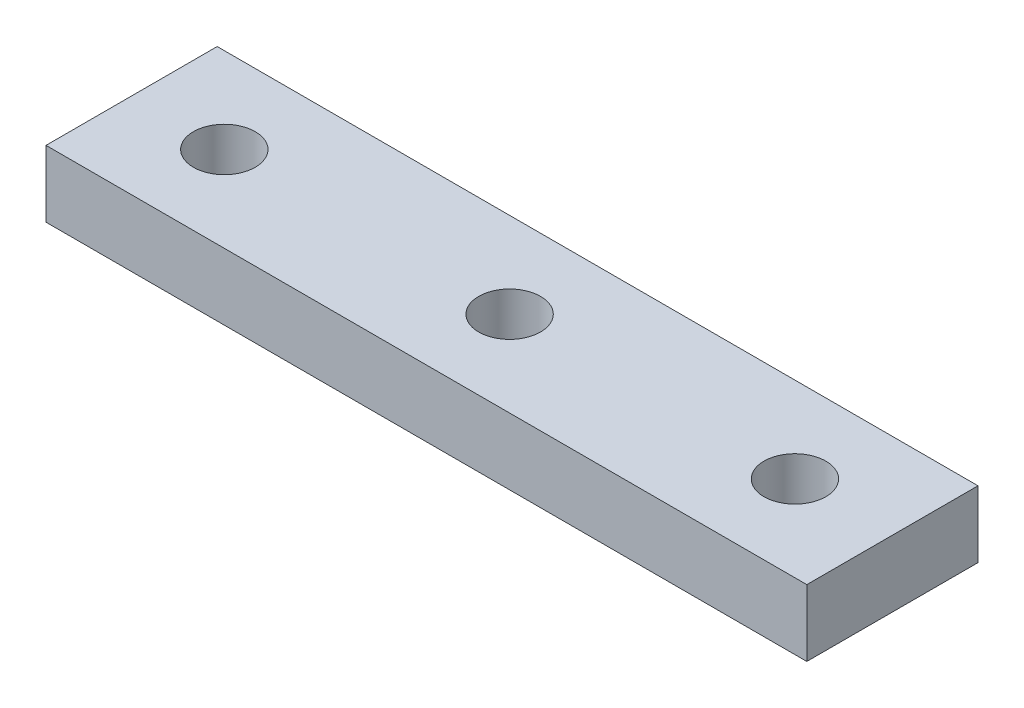
ISO-10303-21;
HEADER;
FILE_DESCRIPTION(('STEP AP214'),'2;1');
FILE_NAME('part.step','',(''),(''),'','','');
FILE_SCHEMA(('AUTOMOTIVE_DESIGN { 1 0 10303 214 1 1 1 1 }'));
ENDSEC;
DATA;
#1=APPLICATION_CONTEXT('core data for automotive mechanical design processes');
#2=APPLICATION_PROTOCOL_DEFINITION('international standard','automotive_design',2000,#1);
#3=PRODUCT_CONTEXT('',#1,'mechanical');
#4=PRODUCT('Part','Part','',(#3));
#5=PRODUCT_RELATED_PRODUCT_CATEGORY('part','',(#4));
#6=PRODUCT_DEFINITION_FORMATION('','',#4);
#7=PRODUCT_DEFINITION_CONTEXT('part definition',#1,'design');
#8=PRODUCT_DEFINITION('design','',#6,#7);
#9=PRODUCT_DEFINITION_SHAPE('','',#8);
#10=(LENGTH_UNIT() NAMED_UNIT(*) SI_UNIT(.MILLI.,.METRE.));
#11=(NAMED_UNIT(*) PLANE_ANGLE_UNIT() SI_UNIT($,.RADIAN.));
#12=(NAMED_UNIT(*) SI_UNIT($,.STERADIAN.) SOLID_ANGLE_UNIT());
#13=UNCERTAINTY_MEASURE_WITH_UNIT(LENGTH_MEASURE(1.E-05),#10,'distance_accuracy_value','');
#14=(GEOMETRIC_REPRESENTATION_CONTEXT(3) GLOBAL_UNCERTAINTY_ASSIGNED_CONTEXT((#13)) GLOBAL_UNIT_ASSIGNED_CONTEXT((#10,
#11,#12)) REPRESENTATION_CONTEXT('',''));
#15=CARTESIAN_POINT('',(0.,0.,0.));
#16=DIRECTION('',(0.,0.,1.));
#17=DIRECTION('',(1.,0.,0.));
#18=AXIS2_PLACEMENT_3D('',#15,#16,#17);
#19=CARTESIAN_POINT('',(0.,7.,0.));
#20=DIRECTION('',(1.,0.,0.));
#21=DIRECTION('',(0.,0.,-1.));
#22=AXIS2_PLACEMENT_3D('',#19,#20,#21);
#23=PLANE('',#22);
#24=DIRECTION('',(0.,0.,1.));
#25=VECTOR('',#24,1.);
#26=CARTESIAN_POINT('',(0.,0.,0.));
#27=LINE('',#26,#25);
#28=CARTESIAN_POINT('',(0.,0.,0.));
#29=VERTEX_POINT('',#28);
#30=CARTESIAN_POINT('',(0.,0.,18.));
#31=VERTEX_POINT('',#30);
#32=EDGE_CURVE('E110',#29,#31,#27,.T.);
#33=ORIENTED_EDGE('',*,*,#32,.T.);
#34=DIRECTION('',(0.,-1.,0.));
#35=VECTOR('',#34,1.);
#36=CARTESIAN_POINT('',(0.,7.,18.));
#37=LINE('',#36,#35);
#38=CARTESIAN_POINT('',(0.,7.,18.));
#39=VERTEX_POINT('',#38);
#40=EDGE_CURVE('E11',#39,#31,#37,.T.);
#41=ORIENTED_EDGE('',*,*,#40,.F.);
#42=DIRECTION('',(0.,0.,1.));
#43=VECTOR('',#42,1.);
#44=CARTESIAN_POINT('',(0.,7.,0.));
#45=LINE('',#44,#43);
#46=CARTESIAN_POINT('',(0.,7.,0.));
#47=VERTEX_POINT('',#46);
#48=EDGE_CURVE('E93',#47,#39,#45,.T.);
#49=ORIENTED_EDGE('',*,*,#48,.F.);
#50=DIRECTION('',(0.,-1.,0.));
#51=VECTOR('',#50,1.);
#52=CARTESIAN_POINT('',(0.,7.,0.));
#53=LINE('',#52,#51);
#54=EDGE_CURVE('E106',#47,#29,#53,.T.);
#55=ORIENTED_EDGE('',*,*,#54,.T.);
#56=EDGE_LOOP('',(#33,#41,#49,#55));
#57=FACE_BOUND('',#56,.T.);
#58=ADVANCED_FACE('F39',(#57),#23,.F.);
#59=CARTESIAN_POINT('',(0.,7.,18.));
#60=DIRECTION('',(0.,0.,-1.));
#61=DIRECTION('',(-1.,0.,0.));
#62=AXIS2_PLACEMENT_3D('',#59,#60,#61);
#63=PLANE('',#62);
#64=DIRECTION('',(1.,0.,0.));
#65=VECTOR('',#64,1.);
#66=CARTESIAN_POINT('',(0.,0.,18.));
#67=LINE('',#66,#65);
#68=CARTESIAN_POINT('',(80.,0.,18.));
#69=VERTEX_POINT('',#68);
#70=EDGE_CURVE('E98',#31,#69,#67,.T.);
#71=ORIENTED_EDGE('',*,*,#70,.T.);
#72=DIRECTION('',(0.,-1.,0.));
#73=VECTOR('',#72,1.);
#74=CARTESIAN_POINT('',(80.,7.,18.));
#75=LINE('',#74,#73);
#76=CARTESIAN_POINT('',(80.,7.,18.));
#77=VERTEX_POINT('',#76);
#78=EDGE_CURVE('E49',#77,#69,#75,.T.);
#79=ORIENTED_EDGE('',*,*,#78,.F.);
#80=DIRECTION('',(1.,0.,0.));
#81=VECTOR('',#80,1.);
#82=CARTESIAN_POINT('',(0.,7.,18.));
#83=LINE('',#82,#81);
#84=EDGE_CURVE('E88',#39,#77,#83,.T.);
#85=ORIENTED_EDGE('',*,*,#84,.F.);
#86=ORIENTED_EDGE('',*,*,#40,.T.);
#87=EDGE_LOOP('',(#71,#79,#85,#86));
#88=FACE_BOUND('',#87,.T.);
#89=ADVANCED_FACE('F97',(#88),#63,.F.);
#90=CARTESIAN_POINT('',(80.,7.,0.));
#91=DIRECTION('',(-1.,0.,0.));
#92=DIRECTION('',(0.,0.,1.));
#93=AXIS2_PLACEMENT_3D('',#90,#91,#92);
#94=PLANE('',#93);
#95=DIRECTION('',(0.,0.,-1.));
#96=VECTOR('',#95,1.);
#97=CARTESIAN_POINT('',(80.,0.,0.));
#98=LINE('',#97,#96);
#99=CARTESIAN_POINT('',(80.,0.,0.));
#100=VERTEX_POINT('',#99);
#101=EDGE_CURVE('E75',#69,#100,#98,.T.);
#102=ORIENTED_EDGE('',*,*,#101,.T.);
#103=DIRECTION('',(0.,-1.,0.));
#104=VECTOR('',#103,1.);
#105=CARTESIAN_POINT('',(80.,7.,0.));
#106=LINE('',#105,#104);
#107=CARTESIAN_POINT('',(80.,7.,0.));
#108=VERTEX_POINT('',#107);
#109=EDGE_CURVE('E100',#108,#100,#106,.T.);
#110=ORIENTED_EDGE('',*,*,#109,.F.);
#111=DIRECTION('',(0.,0.,-1.));
#112=VECTOR('',#111,1.);
#113=CARTESIAN_POINT('',(80.,7.,0.));
#114=LINE('',#113,#112);
#115=EDGE_CURVE('E91',#77,#108,#114,.T.);
#116=ORIENTED_EDGE('',*,*,#115,.F.);
#117=ORIENTED_EDGE('',*,*,#78,.T.);
#118=EDGE_LOOP('',(#102,#110,#116,#117));
#119=FACE_BOUND('',#118,.T.);
#120=ADVANCED_FACE('F102',(#119),#94,.F.);
#121=CARTESIAN_POINT('',(0.,7.,0.));
#122=DIRECTION('',(0.,0.,1.));
#123=DIRECTION('',(1.,0.,0.));
#124=AXIS2_PLACEMENT_3D('',#121,#122,#123);
#125=PLANE('',#124);
#126=DIRECTION('',(-1.,0.,0.));
#127=VECTOR('',#126,1.);
#128=CARTESIAN_POINT('',(0.,0.,0.));
#129=LINE('',#128,#127);
#130=EDGE_CURVE('E81',#100,#29,#129,.T.);
#131=ORIENTED_EDGE('',*,*,#130,.T.);
#132=ORIENTED_EDGE('',*,*,#54,.F.);
#133=DIRECTION('',(-1.,0.,0.));
#134=VECTOR('',#133,1.);
#135=CARTESIAN_POINT('',(0.,7.,0.));
#136=LINE('',#135,#134);
#137=EDGE_CURVE('E58',#108,#47,#136,.T.);
#138=ORIENTED_EDGE('',*,*,#137,.F.);
#139=ORIENTED_EDGE('',*,*,#109,.T.);
#140=EDGE_LOOP('',(#131,#132,#138,#139));
#141=FACE_BOUND('',#140,.T.);
#142=ADVANCED_FACE('F192',(#141),#125,.F.);
#143=CARTESIAN_POINT('',(0.,7.,0.));
#144=DIRECTION('',(0.,1.,0.));
#145=DIRECTION('',(0.,0.,1.));
#146=AXIS2_PLACEMENT_3D('',#143,#144,#145);
#147=PLANE('',#146);
#148=CARTESIAN_POINT('',(9.75,7.,9.));
#149=DIRECTION('',(0.,1.,0.));
#150=DIRECTION('',(0.,0.,1.));
#151=AXIS2_PLACEMENT_3D('',#148,#149,#150);
#152=CIRCLE('',#151,3.25);
#153=CARTESIAN_POINT('',(9.75,7.,12.25));
#154=VERTEX_POINT('',#153);
#155=EDGE_CURVE('E154',#154,#154,#152,.T.);
#156=ORIENTED_EDGE('',*,*,#155,.F.);
#157=EDGE_LOOP('',(#156));
#158=FACE_BOUND('',#157,.T.);
#159=CARTESIAN_POINT('',(39.75,7.,9.));
#160=DIRECTION('',(0.,1.,0.));
#161=DIRECTION('',(0.,0.,1.));
#162=AXIS2_PLACEMENT_3D('',#159,#160,#161);
#163=CIRCLE('',#162,3.25);
#164=CARTESIAN_POINT('',(39.75,7.,12.25));
#165=VERTEX_POINT('',#164);
#166=EDGE_CURVE('E147',#165,#165,#163,.T.);
#167=ORIENTED_EDGE('',*,*,#166,.F.);
#168=EDGE_LOOP('',(#167));
#169=FACE_BOUND('',#168,.T.);
#170=CARTESIAN_POINT('',(69.75,7.,9.));
#171=DIRECTION('',(0.,1.,0.));
#172=DIRECTION('',(0.,0.,1.));
#173=AXIS2_PLACEMENT_3D('',#170,#171,#172);
#174=CIRCLE('',#173,3.25000000000001);
#175=CARTESIAN_POINT('',(69.75,7.,12.25));
#176=VERTEX_POINT('',#175);
#177=EDGE_CURVE('E136',#176,#176,#174,.T.);
#178=ORIENTED_EDGE('',*,*,#177,.F.);
#179=EDGE_LOOP('',(#178));
#180=FACE_BOUND('',#179,.T.);
#181=ORIENTED_EDGE('',*,*,#48,.T.);
#182=ORIENTED_EDGE('',*,*,#84,.T.);
#183=ORIENTED_EDGE('',*,*,#115,.T.);
#184=ORIENTED_EDGE('',*,*,#137,.T.);
#185=EDGE_LOOP('',(#181,#182,#183,#184));
#186=FACE_BOUND('',#185,.T.);
#187=ADVANCED_FACE('F89',(#158,#169,#180,#186),#147,.T.);
#188=CARTESIAN_POINT('',(0.,0.,0.));
#189=DIRECTION('',(0.,1.,0.));
#190=DIRECTION('',(0.,0.,1.));
#191=AXIS2_PLACEMENT_3D('',#188,#189,#190);
#192=PLANE('',#191);
#193=CARTESIAN_POINT('',(9.75,0.,9.));
#194=DIRECTION('',(0.,-1.,0.));
#195=DIRECTION('',(0.,0.,-1.));
#196=AXIS2_PLACEMENT_3D('',#193,#194,#195);
#197=CIRCLE('',#196,1.75);
#198=CARTESIAN_POINT('',(9.75,0.,7.25));
#199=VERTEX_POINT('',#198);
#200=EDGE_CURVE('E129',#199,#199,#197,.T.);
#201=ORIENTED_EDGE('',*,*,#200,.F.);
#202=EDGE_LOOP('',(#201));
#203=FACE_BOUND('',#202,.T.);
#204=CARTESIAN_POINT('',(39.75,0.,9.));
#205=DIRECTION('',(0.,-1.,0.));
#206=DIRECTION('',(0.,0.,-1.));
#207=AXIS2_PLACEMENT_3D('',#204,#205,#206);
#208=CIRCLE('',#207,1.75);
#209=CARTESIAN_POINT('',(39.75,0.,7.25));
#210=VERTEX_POINT('',#209);
#211=EDGE_CURVE('E171',#210,#210,#208,.T.);
#212=ORIENTED_EDGE('',*,*,#211,.F.);
#213=EDGE_LOOP('',(#212));
#214=FACE_BOUND('',#213,.T.);
#215=CARTESIAN_POINT('',(69.75,0.,9.));
#216=DIRECTION('',(0.,-1.,0.));
#217=DIRECTION('',(0.,0.,-1.));
#218=AXIS2_PLACEMENT_3D('',#215,#216,#217);
#219=CIRCLE('',#218,1.75);
#220=CARTESIAN_POINT('',(69.75,0.,7.25));
#221=VERTEX_POINT('',#220);
#222=EDGE_CURVE('E167',#221,#221,#219,.T.);
#223=ORIENTED_EDGE('',*,*,#222,.F.);
#224=EDGE_LOOP('',(#223));
#225=FACE_BOUND('',#224,.T.);
#226=ORIENTED_EDGE('',*,*,#32,.F.);
#227=ORIENTED_EDGE('',*,*,#130,.F.);
#228=ORIENTED_EDGE('',*,*,#101,.F.);
#229=ORIENTED_EDGE('',*,*,#70,.F.);
#230=EDGE_LOOP('',(#226,#227,#228,#229));
#231=FACE_BOUND('',#230,.T.);
#232=ADVANCED_FACE('F181',(#203,#214,#225,#231),#192,.F.);
#233=CARTESIAN_POINT('',(69.75,2.,9.));
#234=DIRECTION('',(0.,1.,0.));
#235=DIRECTION('',(0.,0.,1.));
#236=AXIS2_PLACEMENT_3D('',#233,#234,#235);
#237=CYLINDRICAL_SURFACE('',#236,3.25000000000001);
#238=CARTESIAN_POINT('',(69.75,2.,9.));
#239=DIRECTION('',(0.,1.,0.));
#240=DIRECTION('',(0.,0.,1.));
#241=AXIS2_PLACEMENT_3D('',#238,#239,#240);
#242=CIRCLE('',#241,3.25000000000001);
#243=CARTESIAN_POINT('',(69.75,2.,12.25));
#244=VERTEX_POINT('',#243);
#245=EDGE_CURVE('E141',#244,#244,#242,.T.);
#246=ORIENTED_EDGE('',*,*,#245,.F.);
#247=EDGE_LOOP('',(#246));
#248=FACE_BOUND('',#247,.T.);
#249=ORIENTED_EDGE('',*,*,#177,.T.);
#250=EDGE_LOOP('',(#249));
#251=FACE_BOUND('',#250,.T.);
#252=ADVANCED_FACE('F184',(#248,#251),#237,.F.);
#253=CARTESIAN_POINT('',(69.75,2.,9.));
#254=DIRECTION('',(0.,1.,0.));
#255=DIRECTION('',(0.,0.,1.));
#256=AXIS2_PLACEMENT_3D('',#253,#254,#255);
#257=PLANE('',#256);
#258=CARTESIAN_POINT('',(69.75,2.,9.));
#259=DIRECTION('',(0.,1.,0.));
#260=DIRECTION('',(0.,0.,1.));
#261=AXIS2_PLACEMENT_3D('',#258,#259,#260);
#262=CIRCLE('',#261,1.75);
#263=CARTESIAN_POINT('',(69.75,2.,10.75));
#264=VERTEX_POINT('',#263);
#265=EDGE_CURVE('E42',#264,#264,#262,.T.);
#266=ORIENTED_EDGE('',*,*,#265,.F.);
#267=EDGE_LOOP('',(#266));
#268=FACE_BOUND('',#267,.T.);
#269=ORIENTED_EDGE('',*,*,#245,.T.);
#270=EDGE_LOOP('',(#269));
#271=FACE_BOUND('',#270,.T.);
#272=ADVANCED_FACE('F232',(#268,#271),#257,.T.);
#273=CARTESIAN_POINT('',(39.75,2.,9.));
#274=DIRECTION('',(0.,1.,0.));
#275=DIRECTION('',(0.,0.,1.));
#276=AXIS2_PLACEMENT_3D('',#273,#274,#275);
#277=CYLINDRICAL_SURFACE('',#276,3.25);
#278=CARTESIAN_POINT('',(39.75,2.,9.));
#279=DIRECTION('',(0.,1.,0.));
#280=DIRECTION('',(0.,0.,1.));
#281=AXIS2_PLACEMENT_3D('',#278,#279,#280);
#282=CIRCLE('',#281,3.25);
#283=CARTESIAN_POINT('',(39.75,2.,12.25));
#284=VERTEX_POINT('',#283);
#285=EDGE_CURVE('E158',#284,#284,#282,.T.);
#286=ORIENTED_EDGE('',*,*,#285,.F.);
#287=EDGE_LOOP('',(#286));
#288=FACE_BOUND('',#287,.T.);
#289=ORIENTED_EDGE('',*,*,#166,.T.);
#290=EDGE_LOOP('',(#289));
#291=FACE_BOUND('',#290,.T.);
#292=ADVANCED_FACE('F240',(#288,#291),#277,.F.);
#293=CARTESIAN_POINT('',(39.75,2.,9.));
#294=DIRECTION('',(0.,1.,0.));
#295=DIRECTION('',(0.,0.,1.));
#296=AXIS2_PLACEMENT_3D('',#293,#294,#295);
#297=PLANE('',#296);
#298=CARTESIAN_POINT('',(39.75,2.,9.));
#299=DIRECTION('',(0.,1.,0.));
#300=DIRECTION('',(0.,0.,1.));
#301=AXIS2_PLACEMENT_3D('',#298,#299,#300);
#302=CIRCLE('',#301,1.75);
#303=CARTESIAN_POINT('',(39.75,2.,10.75));
#304=VERTEX_POINT('',#303);
#305=EDGE_CURVE('E128',#304,#304,#302,.T.);
#306=ORIENTED_EDGE('',*,*,#305,.F.);
#307=EDGE_LOOP('',(#306));
#308=FACE_BOUND('',#307,.T.);
#309=ORIENTED_EDGE('',*,*,#285,.T.);
#310=EDGE_LOOP('',(#309));
#311=FACE_BOUND('',#310,.T.);
#312=ADVANCED_FACE('F245',(#308,#311),#297,.T.);
#313=CARTESIAN_POINT('',(9.75,2.,9.));
#314=DIRECTION('',(0.,1.,0.));
#315=DIRECTION('',(0.,0.,1.));
#316=AXIS2_PLACEMENT_3D('',#313,#314,#315);
#317=CYLINDRICAL_SURFACE('',#316,3.25);
#318=CARTESIAN_POINT('',(9.75,2.,9.));
#319=DIRECTION('',(0.,1.,0.));
#320=DIRECTION('',(0.,0.,1.));
#321=AXIS2_PLACEMENT_3D('',#318,#319,#320);
#322=CIRCLE('',#321,3.25);
#323=CARTESIAN_POINT('',(9.75,2.,12.25));
#324=VERTEX_POINT('',#323);
#325=EDGE_CURVE('E114',#324,#324,#322,.T.);
#326=ORIENTED_EDGE('',*,*,#325,.F.);
#327=EDGE_LOOP('',(#326));
#328=FACE_BOUND('',#327,.T.);
#329=ORIENTED_EDGE('',*,*,#155,.T.);
#330=EDGE_LOOP('',(#329));
#331=FACE_BOUND('',#330,.T.);
#332=ADVANCED_FACE('F253',(#328,#331),#317,.F.);
#333=CARTESIAN_POINT('',(9.75,2.,9.));
#334=DIRECTION('',(0.,1.,0.));
#335=DIRECTION('',(0.,0.,1.));
#336=AXIS2_PLACEMENT_3D('',#333,#334,#335);
#337=PLANE('',#336);
#338=CARTESIAN_POINT('',(9.75,2.,9.));
#339=DIRECTION('',(0.,1.,0.));
#340=DIRECTION('',(0.,0.,1.));
#341=AXIS2_PLACEMENT_3D('',#338,#339,#340);
#342=CIRCLE('',#341,1.75);
#343=CARTESIAN_POINT('',(9.75,2.,10.75));
#344=VERTEX_POINT('',#343);
#345=EDGE_CURVE('E125',#344,#344,#342,.T.);
#346=ORIENTED_EDGE('',*,*,#345,.F.);
#347=EDGE_LOOP('',(#346));
#348=FACE_BOUND('',#347,.T.);
#349=ORIENTED_EDGE('',*,*,#325,.T.);
#350=EDGE_LOOP('',(#349));
#351=FACE_BOUND('',#350,.T.);
#352=ADVANCED_FACE('F258',(#348,#351),#337,.T.);
#353=CARTESIAN_POINT('',(9.75,7.,9.));
#354=DIRECTION('',(0.,-1.,0.));
#355=DIRECTION('',(0.,0.,-1.));
#356=AXIS2_PLACEMENT_3D('',#353,#354,#355);
#357=CYLINDRICAL_SURFACE('',#356,1.75);
#358=ORIENTED_EDGE('',*,*,#345,.T.);
#359=EDGE_LOOP('',(#358));
#360=FACE_BOUND('',#359,.T.);
#361=ORIENTED_EDGE('',*,*,#200,.T.);
#362=EDGE_LOOP('',(#361));
#363=FACE_BOUND('',#362,.T.);
#364=ADVANCED_FACE('F179',(#360,#363),#357,.F.);
#365=CARTESIAN_POINT('',(39.75,7.,9.));
#366=DIRECTION('',(0.,-1.,0.));
#367=DIRECTION('',(0.,0.,-1.));
#368=AXIS2_PLACEMENT_3D('',#365,#366,#367);
#369=CYLINDRICAL_SURFACE('',#368,1.75);
#370=ORIENTED_EDGE('',*,*,#305,.T.);
#371=EDGE_LOOP('',(#370));
#372=FACE_BOUND('',#371,.T.);
#373=ORIENTED_EDGE('',*,*,#211,.T.);
#374=EDGE_LOOP('',(#373));
#375=FACE_BOUND('',#374,.T.);
#376=ADVANCED_FACE('F296',(#372,#375),#369,.F.);
#377=CARTESIAN_POINT('',(69.75,7.,9.));
#378=DIRECTION('',(0.,-1.,0.));
#379=DIRECTION('',(0.,0.,-1.));
#380=AXIS2_PLACEMENT_3D('',#377,#378,#379);
#381=CYLINDRICAL_SURFACE('',#380,1.75);
#382=ORIENTED_EDGE('',*,*,#265,.T.);
#383=EDGE_LOOP('',(#382));
#384=FACE_BOUND('',#383,.T.);
#385=ORIENTED_EDGE('',*,*,#222,.T.);
#386=EDGE_LOOP('',(#385));
#387=FACE_BOUND('',#386,.T.);
#388=ADVANCED_FACE('F306',(#384,#387),#381,.F.);
#389=CLOSED_SHELL('',(#58,#89,#120,#142,#187,#232,#252,#272,#292,#312,#332,#352,#364,#376,#388));
#390=MANIFOLD_SOLID_BREP('B2',#389);
#391=ADVANCED_BREP_SHAPE_REPRESENTATION('',(#18,#390),#14);
#392=SHAPE_DEFINITION_REPRESENTATION(#9,#391);
ENDSEC;
END-ISO-10303-21;
